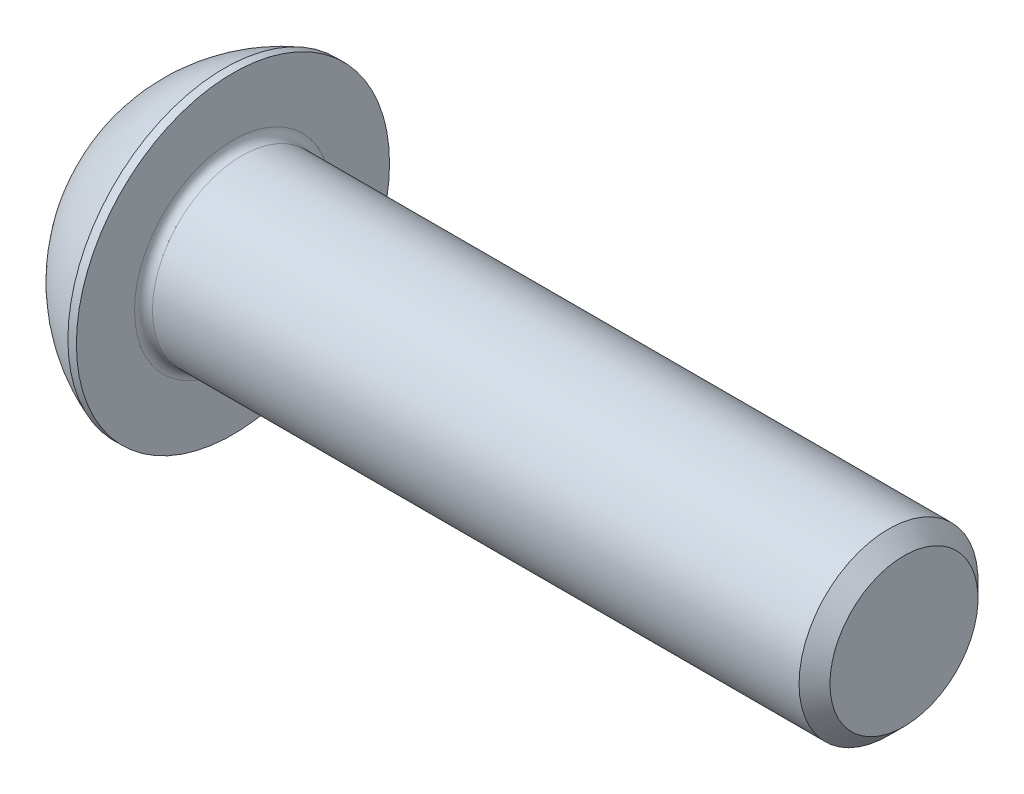
ISO-10303-21;
HEADER;
FILE_DESCRIPTION(('STEP AP214'),'2;1');
FILE_NAME('part.step','',(''),(''),'','','');
FILE_SCHEMA(('AUTOMOTIVE_DESIGN { 1 0 10303 214 1 1 1 1 }'));
ENDSEC;
DATA;
#1=APPLICATION_CONTEXT('core data for automotive mechanical design processes');
#2=APPLICATION_PROTOCOL_DEFINITION('international standard','automotive_design',2000,#1);
#3=PRODUCT_CONTEXT('',#1,'mechanical');
#4=PRODUCT('Part','Part','',(#3));
#5=PRODUCT_RELATED_PRODUCT_CATEGORY('part','',(#4));
#6=PRODUCT_DEFINITION_FORMATION('','',#4);
#7=PRODUCT_DEFINITION_CONTEXT('part definition',#1,'design');
#8=PRODUCT_DEFINITION('design','',#6,#7);
#9=PRODUCT_DEFINITION_SHAPE('','',#8);
#10=(LENGTH_UNIT() NAMED_UNIT(*) SI_UNIT(.MILLI.,.METRE.));
#11=(NAMED_UNIT(*) PLANE_ANGLE_UNIT() SI_UNIT($,.RADIAN.));
#12=(NAMED_UNIT(*) SI_UNIT($,.STERADIAN.) SOLID_ANGLE_UNIT());
#13=UNCERTAINTY_MEASURE_WITH_UNIT(LENGTH_MEASURE(1.E-05),#10,'distance_accuracy_value','');
#14=(GEOMETRIC_REPRESENTATION_CONTEXT(3) GLOBAL_UNCERTAINTY_ASSIGNED_CONTEXT((#13)) GLOBAL_UNIT_ASSIGNED_CONTEXT((#10,
#11,#12)) REPRESENTATION_CONTEXT('',''));
#15=CARTESIAN_POINT('',(0.,0.,0.));
#16=DIRECTION('',(0.,0.,1.));
#17=DIRECTION('',(1.,0.,0.));
#18=AXIS2_PLACEMENT_3D('',#15,#16,#17);
#19=CARTESIAN_POINT('',(0.,0.,0.));
#20=DIRECTION('',(-1.,0.,0.));
#21=DIRECTION('',(0.,0.,1.));
#22=AXIS2_PLACEMENT_3D('',#19,#20,#21);
#23=PLANE('',#22);
#24=CARTESIAN_POINT('',(0.,0.,0.));
#25=DIRECTION('',(-1.,0.,0.));
#26=DIRECTION('',(0.,0.,1.));
#27=AXIS2_PLACEMENT_3D('',#24,#25,#26);
#28=CIRCLE('',#27,3.5);
#29=CARTESIAN_POINT('',(0.,0.,3.5));
#30=VERTEX_POINT('',#29);
#31=EDGE_CURVE('E152',#30,#30,#28,.T.);
#32=ORIENTED_EDGE('',*,*,#31,.T.);
#33=EDGE_LOOP('',(#32));
#34=FACE_BOUND('',#33,.T.);
#35=DIRECTION('',(0.,-1.,0.));
#36=VECTOR('',#35,1.);
#37=CARTESIAN_POINT('',(0.,-1.44337567297406,2.5));
#38=LINE('',#37,#36);
#39=CARTESIAN_POINT('',(0.,1.44337567297406,2.5));
#40=VERTEX_POINT('',#39);
#41=CARTESIAN_POINT('',(0.,-1.44337567297406,2.5));
#42=VERTEX_POINT('',#41);
#43=EDGE_CURVE('E47',#40,#42,#38,.T.);
#44=ORIENTED_EDGE('',*,*,#43,.T.);
#45=DIRECTION('',(0.,-0.500000000000001,-0.866025403784438));
#46=VECTOR('',#45,1.);
#47=CARTESIAN_POINT('',(0.,-2.88675134594813,0.));
#48=LINE('',#47,#46);
#49=CARTESIAN_POINT('',(0.,-2.88675134594813,0.));
#50=VERTEX_POINT('',#49);
#51=EDGE_CURVE('E272',#42,#50,#48,.T.);
#52=ORIENTED_EDGE('',*,*,#51,.T.);
#53=DIRECTION('',(0.,0.5,-0.866025403784438));
#54=VECTOR('',#53,1.);
#55=CARTESIAN_POINT('',(0.,-1.44337567297406,-2.5));
#56=LINE('',#55,#54);
#57=CARTESIAN_POINT('',(0.,-1.44337567297406,-2.5));
#58=VERTEX_POINT('',#57);
#59=EDGE_CURVE('E127',#50,#58,#56,.T.);
#60=ORIENTED_EDGE('',*,*,#59,.T.);
#61=DIRECTION('',(0.,1.,0.));
#62=VECTOR('',#61,1.);
#63=CARTESIAN_POINT('',(0.,1.44337567297407,-2.5));
#64=LINE('',#63,#62);
#65=CARTESIAN_POINT('',(0.,1.44337567297407,-2.5));
#66=VERTEX_POINT('',#65);
#67=EDGE_CURVE('E275',#58,#66,#64,.T.);
#68=ORIENTED_EDGE('',*,*,#67,.T.);
#69=DIRECTION('',(0.,0.5,0.866025403784439));
#70=VECTOR('',#69,1.);
#71=CARTESIAN_POINT('',(0.,2.88675134594813,0.));
#72=LINE('',#71,#70);
#73=CARTESIAN_POINT('',(0.,2.88675134594813,0.));
#74=VERTEX_POINT('',#73);
#75=EDGE_CURVE('E277',#66,#74,#72,.T.);
#76=ORIENTED_EDGE('',*,*,#75,.T.);
#77=DIRECTION('',(0.,-0.5,0.866025403784439));
#78=VECTOR('',#77,1.);
#79=CARTESIAN_POINT('',(0.,1.44337567297406,2.5));
#80=LINE('',#79,#78);
#81=EDGE_CURVE('E279',#74,#40,#80,.T.);
#82=ORIENTED_EDGE('',*,*,#81,.T.);
#83=EDGE_LOOP('',(#44,#52,#60,#68,#76,#82));
#84=FACE_BOUND('',#83,.T.);
#85=ADVANCED_FACE('F32',(#34,#84),#23,.T.);
#86=CARTESIAN_POINT('',(6.58089552238806,0.,0.));
#87=DIRECTION('',(-1.,0.,0.));
#88=DIRECTION('',(0.,1.,0.));
#89=AXIS2_PLACEMENT_3D('',#86,#87,#88);
#90=SPHERICAL_SURFACE('',#89,7.45373637020972);
#91=CARTESIAN_POINT('',(4.02,0.,0.));
#92=DIRECTION('',(-1.,0.,0.));
#93=DIRECTION('',(0.,0.,1.));
#94=AXIS2_PLACEMENT_3D('',#91,#92,#93);
#95=CIRCLE('',#94,7.);
#96=CARTESIAN_POINT('',(4.02,0.,7.));
#97=VERTEX_POINT('',#96);
#98=EDGE_CURVE('E149',#97,#97,#95,.T.);
#99=ORIENTED_EDGE('',*,*,#98,.T.);
#100=EDGE_LOOP('',(#99));
#101=FACE_BOUND('',#100,.T.);
#102=ORIENTED_EDGE('',*,*,#31,.F.);
#103=EDGE_LOOP('',(#102));
#104=FACE_BOUND('',#103,.T.);
#105=ADVANCED_FACE('F173',(#101,#104),#90,.T.);
#106=CARTESIAN_POINT('',(0.,0.,0.));
#107=DIRECTION('',(-1.,0.,0.));
#108=DIRECTION('',(0.,0.,1.));
#109=AXIS2_PLACEMENT_3D('',#106,#107,#108);
#110=CYLINDRICAL_SURFACE('',#109,7.);
#111=ORIENTED_EDGE('',*,*,#98,.F.);
#112=EDGE_LOOP('',(#111));
#113=FACE_BOUND('',#112,.T.);
#114=CARTESIAN_POINT('',(4.4,0.,0.));
#115=DIRECTION('',(-1.,0.,0.));
#116=DIRECTION('',(0.,0.,1.));
#117=AXIS2_PLACEMENT_3D('',#114,#115,#116);
#118=CIRCLE('',#117,7.);
#119=CARTESIAN_POINT('',(4.4,0.,7.));
#120=VERTEX_POINT('',#119);
#121=EDGE_CURVE('E146',#120,#120,#118,.T.);
#122=ORIENTED_EDGE('',*,*,#121,.T.);
#123=EDGE_LOOP('',(#122));
#124=FACE_BOUND('',#123,.T.);
#125=ADVANCED_FACE('F178',(#113,#124),#110,.T.);
#126=CARTESIAN_POINT('',(4.4,4.,0.));
#127=DIRECTION('',(-1.,0.,0.));
#128=DIRECTION('',(0.,0.,1.));
#129=AXIS2_PLACEMENT_3D('',#126,#127,#128);
#130=PLANE('',#129);
#131=CARTESIAN_POINT('',(4.4,0.,0.));
#132=DIRECTION('',(-1.,0.,0.));
#133=DIRECTION('',(0.,0.,1.));
#134=AXIS2_PLACEMENT_3D('',#131,#132,#133);
#135=CIRCLE('',#134,4.4);
#136=CARTESIAN_POINT('',(4.4,0.,4.4));
#137=VERTEX_POINT('',#136);
#138=EDGE_CURVE('E40',#137,#137,#135,.T.);
#139=ORIENTED_EDGE('',*,*,#138,.T.);
#140=EDGE_LOOP('',(#139));
#141=FACE_BOUND('',#140,.T.);
#142=ORIENTED_EDGE('',*,*,#121,.F.);
#143=EDGE_LOOP('',(#142));
#144=FACE_BOUND('',#143,.T.);
#145=ADVANCED_FACE('F157',(#141,#144),#130,.F.);
#146=CARTESIAN_POINT('',(0.,0.,0.));
#147=DIRECTION('',(-1.,0.,0.));
#148=DIRECTION('',(0.,0.,1.));
#149=AXIS2_PLACEMENT_3D('',#146,#147,#148);
#150=CYLINDRICAL_SURFACE('',#149,4.);
#151=CARTESIAN_POINT('',(4.8,0.,0.));
#152=DIRECTION('',(-1.,0.,0.));
#153=DIRECTION('',(0.,0.,1.));
#154=AXIS2_PLACEMENT_3D('',#151,#152,#153);
#155=CIRCLE('',#154,4.);
#156=CARTESIAN_POINT('',(4.8,0.,4.));
#157=VERTEX_POINT('',#156);
#158=EDGE_CURVE('E11',#157,#157,#155,.F.);
#159=ORIENTED_EDGE('',*,*,#158,.T.);
#160=EDGE_LOOP('',(#159));
#161=FACE_BOUND('',#160,.T.);
#162=CARTESIAN_POINT('',(33.7095,0.,0.));
#163=DIRECTION('',(-1.,0.,0.));
#164=DIRECTION('',(0.,0.,1.));
#165=AXIS2_PLACEMENT_3D('',#162,#163,#164);
#166=CIRCLE('',#165,4.);
#167=CARTESIAN_POINT('',(33.7095,0.,4.));
#168=VERTEX_POINT('',#167);
#169=EDGE_CURVE('E143',#168,#168,#166,.T.);
#170=ORIENTED_EDGE('',*,*,#169,.T.);
#171=EDGE_LOOP('',(#170));
#172=FACE_BOUND('',#171,.T.);
#173=ADVANCED_FACE('F187',(#161,#172),#150,.T.);
#174=CARTESIAN_POINT('',(34.4,0.,0.));
#175=DIRECTION('',(-1.,0.,0.));
#176=DIRECTION('',(0.,0.,1.));
#177=AXIS2_PLACEMENT_3D('',#174,#175,#176);
#178=CONICAL_SURFACE('',#177,3.3095,0.785398163397433);
#179=ORIENTED_EDGE('',*,*,#169,.F.);
#180=EDGE_LOOP('',(#179));
#181=FACE_BOUND('',#180,.T.);
#182=CARTESIAN_POINT('',(34.4,0.,0.));
#183=DIRECTION('',(-1.,0.,0.));
#184=DIRECTION('',(0.,0.,1.));
#185=AXIS2_PLACEMENT_3D('',#182,#183,#184);
#186=CIRCLE('',#185,3.3095);
#187=CARTESIAN_POINT('',(34.4,0.,3.3095));
#188=VERTEX_POINT('',#187);
#189=EDGE_CURVE('E139',#188,#188,#186,.T.);
#190=ORIENTED_EDGE('',*,*,#189,.T.);
#191=EDGE_LOOP('',(#190));
#192=FACE_BOUND('',#191,.T.);
#193=ADVANCED_FACE('F168',(#181,#192),#178,.T.);
#194=CARTESIAN_POINT('',(34.4,0.,0.));
#195=DIRECTION('',(-1.,0.,0.));
#196=DIRECTION('',(0.,0.,1.));
#197=AXIS2_PLACEMENT_3D('',#194,#195,#196);
#198=PLANE('',#197);
#199=ORIENTED_EDGE('',*,*,#189,.F.);
#200=EDGE_LOOP('',(#199));
#201=FACE_BOUND('',#200,.T.);
#202=ADVANCED_FACE('F161',(#201),#198,.F.);
#203=CARTESIAN_POINT('',(4.8,0.,0.));
#204=DIRECTION('',(-1.,0.,0.));
#205=DIRECTION('',(0.,0.,1.));
#206=AXIS2_PLACEMENT_3D('',#203,#204,#205);
#207=TOROIDAL_SURFACE('',#206,4.4,0.4);
#208=ORIENTED_EDGE('',*,*,#158,.F.);
#209=EDGE_LOOP('',(#208));
#210=FACE_BOUND('',#209,.T.);
#211=ORIENTED_EDGE('',*,*,#138,.F.);
#212=EDGE_LOOP('',(#211));
#213=FACE_BOUND('',#212,.T.);
#214=ADVANCED_FACE('F34',(#210,#213),#207,.F.);
#215=CARTESIAN_POINT('',(2.6,-2.88675134594813,0.));
#216=DIRECTION('',(0.,0.866025403784438,-0.500000000000001));
#217=DIRECTION('',(0.,0.500000000000001,0.866025403784438));
#218=AXIS2_PLACEMENT_3D('',#215,#216,#217);
#219=PLANE('',#218);
#220=DIRECTION('',(0.,-0.500000000000001,-0.866025403784438));
#221=VECTOR('',#220,1.);
#222=CARTESIAN_POINT('',(2.6,-2.88675134594813,0.));
#223=LINE('',#222,#221);
#224=CARTESIAN_POINT('',(2.6,-1.44337567297406,2.5));
#225=VERTEX_POINT('',#224);
#226=CARTESIAN_POINT('',(2.6,-2.16506350946109,1.25));
#227=VERTEX_POINT('',#226);
#228=EDGE_CURVE('E113',#225,#227,#223,.T.);
#229=ORIENTED_EDGE('',*,*,#228,.T.);
#230=CARTESIAN_POINT('',(2.6,-2.88675134594813,0.));
#231=VERTEX_POINT('',#230);
#232=EDGE_CURVE('E108',#227,#231,#223,.T.);
#233=ORIENTED_EDGE('',*,*,#232,.T.);
#234=DIRECTION('',(-1.,0.,0.));
#235=VECTOR('',#234,1.);
#236=CARTESIAN_POINT('',(2.6,-2.88675134594813,0.));
#237=LINE('',#236,#235);
#238=EDGE_CURVE('E110',#231,#50,#237,.T.);
#239=ORIENTED_EDGE('',*,*,#238,.T.);
#240=ORIENTED_EDGE('',*,*,#51,.F.);
#241=DIRECTION('',(-1.,0.,0.));
#242=VECTOR('',#241,1.);
#243=CARTESIAN_POINT('',(2.6,-1.44337567297406,2.5));
#244=LINE('',#243,#242);
#245=EDGE_CURVE('E268',#225,#42,#244,.T.);
#246=ORIENTED_EDGE('',*,*,#245,.F.);
#247=EDGE_LOOP('',(#229,#233,#239,#240,#246));
#248=FACE_BOUND('',#247,.T.);
#249=ADVANCED_FACE('F109',(#248),#219,.T.);
#250=CARTESIAN_POINT('',(2.6,-1.44337567297406,-2.5));
#251=DIRECTION('',(0.,0.866025403784438,0.5));
#252=DIRECTION('',(0.,-0.5,0.866025403784438));
#253=AXIS2_PLACEMENT_3D('',#250,#251,#252);
#254=PLANE('',#253);
#255=DIRECTION('',(0.,0.5,-0.866025403784438));
#256=VECTOR('',#255,1.);
#257=CARTESIAN_POINT('',(2.6,-1.44337567297406,-2.5));
#258=LINE('',#257,#256);
#259=CARTESIAN_POINT('',(2.6,-2.1650635094611,-1.25));
#260=VERTEX_POINT('',#259);
#261=EDGE_CURVE('E55',#231,#260,#258,.T.);
#262=ORIENTED_EDGE('',*,*,#261,.T.);
#263=CARTESIAN_POINT('',(2.6,-1.44337567297406,-2.5));
#264=VERTEX_POINT('',#263);
#265=EDGE_CURVE('E122',#260,#264,#258,.T.);
#266=ORIENTED_EDGE('',*,*,#265,.T.);
#267=DIRECTION('',(-1.,0.,0.));
#268=VECTOR('',#267,1.);
#269=CARTESIAN_POINT('',(2.6,-1.44337567297406,-2.5));
#270=LINE('',#269,#268);
#271=EDGE_CURVE('E129',#264,#58,#270,.T.);
#272=ORIENTED_EDGE('',*,*,#271,.T.);
#273=ORIENTED_EDGE('',*,*,#59,.F.);
#274=ORIENTED_EDGE('',*,*,#238,.F.);
#275=EDGE_LOOP('',(#262,#266,#272,#273,#274));
#276=FACE_BOUND('',#275,.T.);
#277=ADVANCED_FACE('F125',(#276),#254,.T.);
#278=CARTESIAN_POINT('',(2.6,1.44337567297407,-2.5));
#279=DIRECTION('',(0.,0.,1.));
#280=DIRECTION('',(0.,-1.,0.));
#281=AXIS2_PLACEMENT_3D('',#278,#279,#280);
#282=PLANE('',#281);
#283=DIRECTION('',(0.,1.,0.));
#284=VECTOR('',#283,1.);
#285=CARTESIAN_POINT('',(2.6,1.44337567297407,-2.5));
#286=LINE('',#285,#284);
#287=CARTESIAN_POINT('',(2.6,0.,-2.5));
#288=VERTEX_POINT('',#287);
#289=EDGE_CURVE('E249',#264,#288,#286,.T.);
#290=ORIENTED_EDGE('',*,*,#289,.T.);
#291=CARTESIAN_POINT('',(2.6,1.44337567297407,-2.5));
#292=VERTEX_POINT('',#291);
#293=EDGE_CURVE('E121',#288,#292,#286,.T.);
#294=ORIENTED_EDGE('',*,*,#293,.T.);
#295=DIRECTION('',(-1.,0.,0.));
#296=VECTOR('',#295,1.);
#297=CARTESIAN_POINT('',(2.6,1.44337567297407,-2.5));
#298=LINE('',#297,#296);
#299=EDGE_CURVE('E134',#292,#66,#298,.T.);
#300=ORIENTED_EDGE('',*,*,#299,.T.);
#301=ORIENTED_EDGE('',*,*,#67,.F.);
#302=ORIENTED_EDGE('',*,*,#271,.F.);
#303=EDGE_LOOP('',(#290,#294,#300,#301,#302));
#304=FACE_BOUND('',#303,.T.);
#305=ADVANCED_FACE('F201',(#304),#282,.T.);
#306=CARTESIAN_POINT('',(2.6,2.88675134594813,0.));
#307=DIRECTION('',(0.,-0.866025403784439,0.5));
#308=DIRECTION('',(0.,-0.5,-0.866025403784439));
#309=AXIS2_PLACEMENT_3D('',#306,#307,#308);
#310=PLANE('',#309);
#311=DIRECTION('',(0.,0.5,0.866025403784439));
#312=VECTOR('',#311,1.);
#313=CARTESIAN_POINT('',(2.6,2.88675134594813,0.));
#314=LINE('',#313,#312);
#315=CARTESIAN_POINT('',(2.6,2.1650635094611,-1.25));
#316=VERTEX_POINT('',#315);
#317=EDGE_CURVE('E238',#292,#316,#314,.T.);
#318=ORIENTED_EDGE('',*,*,#317,.T.);
#319=CARTESIAN_POINT('',(2.6,2.88675134594813,0.));
#320=VERTEX_POINT('',#319);
#321=EDGE_CURVE('E243',#316,#320,#314,.T.);
#322=ORIENTED_EDGE('',*,*,#321,.T.);
#323=DIRECTION('',(-1.,0.,0.));
#324=VECTOR('',#323,1.);
#325=CARTESIAN_POINT('',(2.6,2.88675134594813,0.));
#326=LINE('',#325,#324);
#327=EDGE_CURVE('E283',#320,#74,#326,.T.);
#328=ORIENTED_EDGE('',*,*,#327,.T.);
#329=ORIENTED_EDGE('',*,*,#75,.F.);
#330=ORIENTED_EDGE('',*,*,#299,.F.);
#331=EDGE_LOOP('',(#318,#322,#328,#329,#330));
#332=FACE_BOUND('',#331,.T.);
#333=ADVANCED_FACE('F204',(#332),#310,.T.);
#334=CARTESIAN_POINT('',(2.6,1.44337567297406,2.5));
#335=DIRECTION('',(0.,-0.866025403784439,-0.5));
#336=DIRECTION('',(0.,0.5,-0.866025403784439));
#337=AXIS2_PLACEMENT_3D('',#334,#335,#336);
#338=PLANE('',#337);
#339=DIRECTION('',(0.,-0.5,0.866025403784439));
#340=VECTOR('',#339,1.);
#341=CARTESIAN_POINT('',(2.6,1.44337567297406,2.5));
#342=LINE('',#341,#340);
#343=CARTESIAN_POINT('',(2.6,2.1650635094611,1.25));
#344=VERTEX_POINT('',#343);
#345=EDGE_CURVE('E246',#320,#344,#342,.T.);
#346=ORIENTED_EDGE('',*,*,#345,.T.);
#347=CARTESIAN_POINT('',(2.6,1.44337567297406,2.5));
#348=VERTEX_POINT('',#347);
#349=EDGE_CURVE('E254',#344,#348,#342,.T.);
#350=ORIENTED_EDGE('',*,*,#349,.T.);
#351=DIRECTION('',(-1.,0.,0.));
#352=VECTOR('',#351,1.);
#353=CARTESIAN_POINT('',(2.6,1.44337567297406,2.5));
#354=LINE('',#353,#352);
#355=EDGE_CURVE('E267',#348,#40,#354,.T.);
#356=ORIENTED_EDGE('',*,*,#355,.T.);
#357=ORIENTED_EDGE('',*,*,#81,.F.);
#358=ORIENTED_EDGE('',*,*,#327,.F.);
#359=EDGE_LOOP('',(#346,#350,#356,#357,#358));
#360=FACE_BOUND('',#359,.T.);
#361=ADVANCED_FACE('F208',(#360),#338,.T.);
#362=CARTESIAN_POINT('',(2.6,-1.44337567297406,2.5));
#363=DIRECTION('',(0.,0.,-1.));
#364=DIRECTION('',(0.,1.,0.));
#365=AXIS2_PLACEMENT_3D('',#362,#363,#364);
#366=PLANE('',#365);
#367=DIRECTION('',(0.,-1.,0.));
#368=VECTOR('',#367,1.);
#369=CARTESIAN_POINT('',(2.6,-1.44337567297406,2.5));
#370=LINE('',#369,#368);
#371=CARTESIAN_POINT('',(2.6,0.,2.5));
#372=VERTEX_POINT('',#371);
#373=EDGE_CURVE('E260',#348,#372,#370,.T.);
#374=ORIENTED_EDGE('',*,*,#373,.T.);
#375=EDGE_CURVE('E262',#372,#225,#370,.T.);
#376=ORIENTED_EDGE('',*,*,#375,.T.);
#377=ORIENTED_EDGE('',*,*,#245,.T.);
#378=ORIENTED_EDGE('',*,*,#43,.F.);
#379=ORIENTED_EDGE('',*,*,#355,.F.);
#380=EDGE_LOOP('',(#374,#376,#377,#378,#379));
#381=FACE_BOUND('',#380,.T.);
#382=ADVANCED_FACE('F212',(#381),#366,.T.);
#383=CARTESIAN_POINT('',(2.6,-2.88675134594813,0.));
#384=DIRECTION('',(1.,0.,0.));
#385=DIRECTION('',(0.,0.,-1.));
#386=AXIS2_PLACEMENT_3D('',#383,#384,#385);
#387=PLANE('',#386);
#388=CARTESIAN_POINT('',(2.6,0.,0.));
#389=DIRECTION('',(-1.,0.,0.));
#390=DIRECTION('',(0.,0.,1.));
#391=AXIS2_PLACEMENT_3D('',#388,#389,#390);
#392=CIRCLE('',#391,2.5);
#393=EDGE_CURVE('E235',#316,#288,#392,.T.);
#394=ORIENTED_EDGE('',*,*,#393,.F.);
#395=ORIENTED_EDGE('',*,*,#317,.F.);
#396=ORIENTED_EDGE('',*,*,#293,.F.);
#397=EDGE_LOOP('',(#394,#395,#396));
#398=FACE_BOUND('',#397,.T.);
#399=ADVANCED_FACE('F216',(#398),#387,.F.);
#400=EDGE_CURVE('E140',#344,#316,#392,.T.);
#401=ORIENTED_EDGE('',*,*,#400,.F.);
#402=ORIENTED_EDGE('',*,*,#345,.F.);
#403=ORIENTED_EDGE('',*,*,#321,.F.);
#404=EDGE_LOOP('',(#401,#402,#403));
#405=FACE_BOUND('',#404,.T.);
#406=ADVANCED_FACE('F225',(#405),#387,.F.);
#407=EDGE_CURVE('E133',#372,#344,#392,.T.);
#408=ORIENTED_EDGE('',*,*,#407,.F.);
#409=ORIENTED_EDGE('',*,*,#373,.F.);
#410=ORIENTED_EDGE('',*,*,#349,.F.);
#411=EDGE_LOOP('',(#408,#409,#410));
#412=FACE_BOUND('',#411,.T.);
#413=ADVANCED_FACE('F230',(#412),#387,.F.);
#414=EDGE_CURVE('E128',#227,#372,#392,.T.);
#415=ORIENTED_EDGE('',*,*,#414,.F.);
#416=ORIENTED_EDGE('',*,*,#228,.F.);
#417=ORIENTED_EDGE('',*,*,#375,.F.);
#418=EDGE_LOOP('',(#415,#416,#417));
#419=FACE_BOUND('',#418,.T.);
#420=ADVANCED_FACE('F223',(#419),#387,.F.);
#421=EDGE_CURVE('E119',#260,#227,#392,.T.);
#422=ORIENTED_EDGE('',*,*,#421,.F.);
#423=ORIENTED_EDGE('',*,*,#261,.F.);
#424=ORIENTED_EDGE('',*,*,#232,.F.);
#425=EDGE_LOOP('',(#422,#423,#424));
#426=FACE_BOUND('',#425,.T.);
#427=ADVANCED_FACE('F118',(#426),#387,.F.);
#428=EDGE_CURVE('E241',#288,#260,#392,.T.);
#429=ORIENTED_EDGE('',*,*,#428,.F.);
#430=ORIENTED_EDGE('',*,*,#289,.F.);
#431=ORIENTED_EDGE('',*,*,#265,.F.);
#432=EDGE_LOOP('',(#429,#430,#431));
#433=FACE_BOUND('',#432,.T.);
#434=ADVANCED_FACE('F196',(#433),#387,.F.);
#435=CARTESIAN_POINT('',(4.04337567297408,0.,0.));
#436=DIRECTION('',(-1.,0.,0.));
#437=DIRECTION('',(0.,0.,1.));
#438=AXIS2_PLACEMENT_3D('',#435,#436,#437);
#439=CONICAL_SURFACE('',#438,0.,1.04719755119659);
#440=ORIENTED_EDGE('',*,*,#407,.T.);
#441=ORIENTED_EDGE('',*,*,#400,.T.);
#442=ORIENTED_EDGE('',*,*,#393,.T.);
#443=ORIENTED_EDGE('',*,*,#428,.T.);
#444=ORIENTED_EDGE('',*,*,#421,.T.);
#445=ORIENTED_EDGE('',*,*,#414,.T.);
#446=EDGE_LOOP('',(#440,#441,#442,#443,#444,#445));
#447=FACE_BOUND('',#446,.T.);
#448=CARTESIAN_POINT('',(4.04337567297408,0.,0.));
#449=VERTEX_POINT('',#448);
#450=VERTEX_LOOP('',#449);
#451=FACE_BOUND('',#450,.T.);
#452=ADVANCED_FACE('F194',(#447,#451),#439,.F.);
#453=CLOSED_SHELL('',(#85,#105,#125,#145,#173,#193,#202,#214,#249,#277,#305,#333,#361,#382,#399,
#406,#413,#420,#427,#434,#452));
#454=MANIFOLD_SOLID_BREP('B2',#453);
#455=ADVANCED_BREP_SHAPE_REPRESENTATION('',(#18,#454),#14);
#456=SHAPE_DEFINITION_REPRESENTATION(#9,#455);
ENDSEC;
END-ISO-10303-21;
